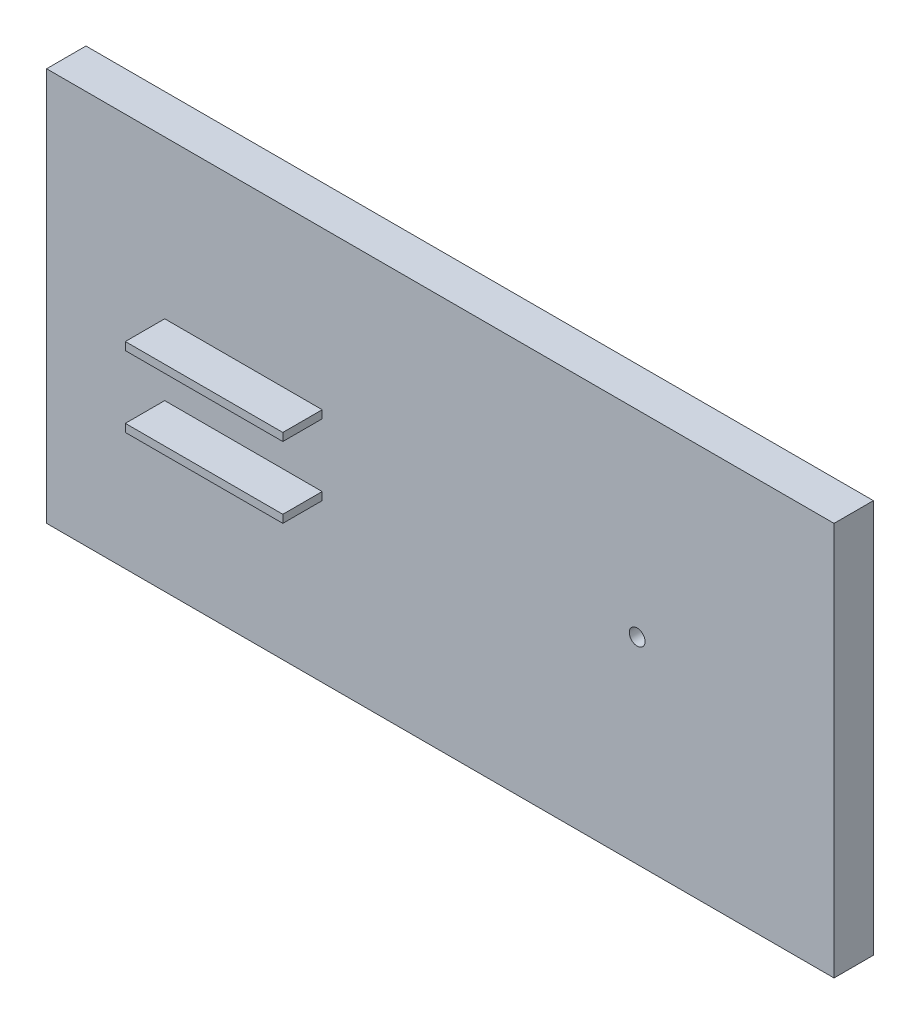
ISO-10303-21;
HEADER;
FILE_DESCRIPTION(('STEP AP214'),'2;1');
FILE_NAME('part.step','',(''),(''),'','','');
FILE_SCHEMA(('AUTOMOTIVE_DESIGN { 1 0 10303 214 1 1 1 1 }'));
ENDSEC;
DATA;
#1=APPLICATION_CONTEXT('core data for automotive mechanical design processes');
#2=APPLICATION_PROTOCOL_DEFINITION('international standard','automotive_design',2000,#1);
#3=PRODUCT_CONTEXT('',#1,'mechanical');
#4=PRODUCT('Part','Part','',(#3));
#5=PRODUCT_RELATED_PRODUCT_CATEGORY('part','',(#4));
#6=PRODUCT_DEFINITION_FORMATION('','',#4);
#7=PRODUCT_DEFINITION_CONTEXT('part definition',#1,'design');
#8=PRODUCT_DEFINITION('design','',#6,#7);
#9=PRODUCT_DEFINITION_SHAPE('','',#8);
#10=(LENGTH_UNIT() NAMED_UNIT(*) SI_UNIT(.MILLI.,.METRE.));
#11=(NAMED_UNIT(*) PLANE_ANGLE_UNIT() SI_UNIT($,.RADIAN.));
#12=(NAMED_UNIT(*) SI_UNIT($,.STERADIAN.) SOLID_ANGLE_UNIT());
#13=UNCERTAINTY_MEASURE_WITH_UNIT(LENGTH_MEASURE(1.E-05),#10,'distance_accuracy_value','');
#14=(GEOMETRIC_REPRESENTATION_CONTEXT(3) GLOBAL_UNCERTAINTY_ASSIGNED_CONTEXT((#13)) GLOBAL_UNIT_ASSIGNED_CONTEXT((#10,
#11,#12)) REPRESENTATION_CONTEXT('',''));
#15=CARTESIAN_POINT('',(0.,0.,0.));
#16=DIRECTION('',(0.,0.,1.));
#17=DIRECTION('',(1.,0.,0.));
#18=AXIS2_PLACEMENT_3D('',#15,#16,#17);
#19=CARTESIAN_POINT('',(-100.,0.,10.));
#20=DIRECTION('',(1.,0.,0.));
#21=DIRECTION('',(0.,0.,-1.));
#22=AXIS2_PLACEMENT_3D('',#19,#20,#21);
#23=PLANE('',#22);
#24=DIRECTION('',(0.,-1.,0.));
#25=VECTOR('',#24,1.);
#26=CARTESIAN_POINT('',(-100.,0.,0.));
#27=LINE('',#26,#25);
#28=CARTESIAN_POINT('',(-100.,50.,0.));
#29=VERTEX_POINT('',#28);
#30=CARTESIAN_POINT('',(-100.,-50.,0.));
#31=VERTEX_POINT('',#30);
#32=EDGE_CURVE('E139',#29,#31,#27,.T.);
#33=ORIENTED_EDGE('',*,*,#32,.T.);
#34=DIRECTION('',(0.,0.,-1.));
#35=VECTOR('',#34,1.);
#36=CARTESIAN_POINT('',(-100.,-50.,10.));
#37=LINE('',#36,#35);
#38=CARTESIAN_POINT('',(-100.,-50.,10.));
#39=VERTEX_POINT('',#38);
#40=EDGE_CURVE('E11',#39,#31,#37,.T.);
#41=ORIENTED_EDGE('',*,*,#40,.F.);
#42=DIRECTION('',(0.,-1.,0.));
#43=VECTOR('',#42,1.);
#44=CARTESIAN_POINT('',(-100.,0.,10.));
#45=LINE('',#44,#43);
#46=CARTESIAN_POINT('',(-100.,50.,10.));
#47=VERTEX_POINT('',#46);
#48=EDGE_CURVE('E80',#47,#39,#45,.T.);
#49=ORIENTED_EDGE('',*,*,#48,.F.);
#50=DIRECTION('',(0.,0.,-1.));
#51=VECTOR('',#50,1.);
#52=CARTESIAN_POINT('',(-100.,50.,10.));
#53=LINE('',#52,#51);
#54=EDGE_CURVE('E96',#47,#29,#53,.T.);
#55=ORIENTED_EDGE('',*,*,#54,.T.);
#56=EDGE_LOOP('',(#33,#41,#49,#55));
#57=FACE_BOUND('',#56,.T.);
#58=ADVANCED_FACE('F33',(#57),#23,.F.);
#59=CARTESIAN_POINT('',(0.,-50.,10.));
#60=DIRECTION('',(0.,-1.,0.));
#61=DIRECTION('',(0.,0.,-1.));
#62=AXIS2_PLACEMENT_3D('',#59,#60,#61);
#63=PLANE('',#62);
#64=DIRECTION('',(-1.,0.,0.));
#65=VECTOR('',#64,1.);
#66=CARTESIAN_POINT('',(0.,-50.,0.));
#67=LINE('',#66,#65);
#68=CARTESIAN_POINT('',(100.,-50.,0.));
#69=VERTEX_POINT('',#68);
#70=EDGE_CURVE('E141',#69,#31,#67,.T.);
#71=ORIENTED_EDGE('',*,*,#70,.F.);
#72=DIRECTION('',(0.,0.,-1.));
#73=VECTOR('',#72,1.);
#74=CARTESIAN_POINT('',(100.,-50.,10.));
#75=LINE('',#74,#73);
#76=CARTESIAN_POINT('',(100.,-50.,10.));
#77=VERTEX_POINT('',#76);
#78=EDGE_CURVE('E41',#77,#69,#75,.T.);
#79=ORIENTED_EDGE('',*,*,#78,.F.);
#80=DIRECTION('',(-1.,0.,0.));
#81=VECTOR('',#80,1.);
#82=CARTESIAN_POINT('',(0.,-50.,10.));
#83=LINE('',#82,#81);
#84=EDGE_CURVE('E104',#77,#39,#83,.T.);
#85=ORIENTED_EDGE('',*,*,#84,.T.);
#86=ORIENTED_EDGE('',*,*,#40,.T.);
#87=EDGE_LOOP('',(#71,#79,#85,#86));
#88=FACE_BOUND('',#87,.T.);
#89=ADVANCED_FACE('F154',(#88),#63,.T.);
#90=CARTESIAN_POINT('',(100.,0.,10.));
#91=DIRECTION('',(1.,0.,0.));
#92=DIRECTION('',(0.,0.,-1.));
#93=AXIS2_PLACEMENT_3D('',#90,#91,#92);
#94=PLANE('',#93);
#95=DIRECTION('',(0.,-1.,0.));
#96=VECTOR('',#95,1.);
#97=CARTESIAN_POINT('',(100.,0.,0.));
#98=LINE('',#97,#96);
#99=CARTESIAN_POINT('',(100.,50.,0.));
#100=VERTEX_POINT('',#99);
#101=EDGE_CURVE('E145',#100,#69,#98,.T.);
#102=ORIENTED_EDGE('',*,*,#101,.F.);
#103=DIRECTION('',(0.,0.,-1.));
#104=VECTOR('',#103,1.);
#105=CARTESIAN_POINT('',(100.,50.,10.));
#106=LINE('',#105,#104);
#107=CARTESIAN_POINT('',(100.,50.,10.));
#108=VERTEX_POINT('',#107);
#109=EDGE_CURVE('E67',#108,#100,#106,.T.);
#110=ORIENTED_EDGE('',*,*,#109,.F.);
#111=DIRECTION('',(0.,-1.,0.));
#112=VECTOR('',#111,1.);
#113=CARTESIAN_POINT('',(100.,0.,10.));
#114=LINE('',#113,#112);
#115=EDGE_CURVE('E93',#108,#77,#114,.T.);
#116=ORIENTED_EDGE('',*,*,#115,.T.);
#117=ORIENTED_EDGE('',*,*,#78,.T.);
#118=EDGE_LOOP('',(#102,#110,#116,#117));
#119=FACE_BOUND('',#118,.T.);
#120=ADVANCED_FACE('F152',(#119),#94,.T.);
#121=CARTESIAN_POINT('',(50.,0.,10.));
#122=DIRECTION('',(0.,0.,-1.));
#123=DIRECTION('',(-1.,0.,0.));
#124=AXIS2_PLACEMENT_3D('',#121,#122,#123);
#125=CYLINDRICAL_SURFACE('',#124,2.);
#126=CARTESIAN_POINT('',(50.,0.,10.));
#127=DIRECTION('',(0.,0.,1.));
#128=DIRECTION('',(1.,0.,0.));
#129=AXIS2_PLACEMENT_3D('',#126,#127,#128);
#130=CIRCLE('',#129,2.);
#131=CARTESIAN_POINT('',(52.,0.,10.));
#132=VERTEX_POINT('',#131);
#133=EDGE_CURVE('E94',#132,#132,#130,.T.);
#134=ORIENTED_EDGE('',*,*,#133,.T.);
#135=EDGE_LOOP('',(#134));
#136=FACE_BOUND('',#135,.T.);
#137=CARTESIAN_POINT('',(50.,0.,0.));
#138=DIRECTION('',(0.,0.,1.));
#139=DIRECTION('',(1.,0.,0.));
#140=AXIS2_PLACEMENT_3D('',#137,#138,#139);
#141=CIRCLE('',#140,2.);
#142=CARTESIAN_POINT('',(52.,0.,0.));
#143=VERTEX_POINT('',#142);
#144=EDGE_CURVE('E105',#143,#143,#141,.T.);
#145=ORIENTED_EDGE('',*,*,#144,.F.);
#146=EDGE_LOOP('',(#145));
#147=FACE_BOUND('',#146,.T.);
#148=ADVANCED_FACE('F163',(#136,#147),#125,.F.);
#149=CARTESIAN_POINT('',(0.,50.,10.));
#150=DIRECTION('',(0.,-1.,0.));
#151=DIRECTION('',(0.,0.,-1.));
#152=AXIS2_PLACEMENT_3D('',#149,#150,#151);
#153=PLANE('',#152);
#154=DIRECTION('',(-1.,0.,0.));
#155=VECTOR('',#154,1.);
#156=CARTESIAN_POINT('',(0.,50.,0.));
#157=LINE('',#156,#155);
#158=EDGE_CURVE('E71',#100,#29,#157,.T.);
#159=ORIENTED_EDGE('',*,*,#158,.T.);
#160=ORIENTED_EDGE('',*,*,#54,.F.);
#161=DIRECTION('',(-1.,0.,0.));
#162=VECTOR('',#161,1.);
#163=CARTESIAN_POINT('',(0.,50.,10.));
#164=LINE('',#163,#162);
#165=EDGE_CURVE('E89',#108,#47,#164,.T.);
#166=ORIENTED_EDGE('',*,*,#165,.F.);
#167=ORIENTED_EDGE('',*,*,#109,.T.);
#168=EDGE_LOOP('',(#159,#160,#166,#167));
#169=FACE_BOUND('',#168,.T.);
#170=ADVANCED_FACE('F97',(#169),#153,.F.);
#171=CARTESIAN_POINT('',(0.,0.,10.));
#172=DIRECTION('',(0.,0.,1.));
#173=DIRECTION('',(1.,0.,0.));
#174=AXIS2_PLACEMENT_3D('',#171,#172,#173);
#175=PLANE('',#174);
#176=ORIENTED_EDGE('',*,*,#48,.T.);
#177=ORIENTED_EDGE('',*,*,#84,.F.);
#178=ORIENTED_EDGE('',*,*,#115,.F.);
#179=ORIENTED_EDGE('',*,*,#165,.T.);
#180=EDGE_LOOP('',(#176,#177,#178,#179));
#181=FACE_BOUND('',#180,.T.);
#182=ORIENTED_EDGE('',*,*,#133,.F.);
#183=EDGE_LOOP('',(#182));
#184=FACE_BOUND('',#183,.T.);
#185=DIRECTION('',(1.,0.,0.));
#186=VECTOR('',#185,1.);
#187=CARTESIAN_POINT('',(0.,-10.,10.));
#188=LINE('',#187,#186);
#189=CARTESIAN_POINT('',(-70.,-10.,10.));
#190=VERTEX_POINT('',#189);
#191=CARTESIAN_POINT('',(-30.,-10.,10.));
#192=VERTEX_POINT('',#191);
#193=EDGE_CURVE('E117',#190,#192,#188,.T.);
#194=ORIENTED_EDGE('',*,*,#193,.F.);
#195=DIRECTION('',(0.,-1.,0.));
#196=VECTOR('',#195,1.);
#197=CARTESIAN_POINT('',(-70.0000000000001,-4.85722573273506E-13,10.));
#198=LINE('',#197,#196);
#199=CARTESIAN_POINT('',(-70.,-8.00000000000001,10.));
#200=VERTEX_POINT('',#199);
#201=EDGE_CURVE('E120',#200,#190,#198,.T.);
#202=ORIENTED_EDGE('',*,*,#201,.F.);
#203=DIRECTION('',(1.,0.,0.));
#204=VECTOR('',#203,1.);
#205=CARTESIAN_POINT('',(0.,-8.00000000000001,10.));
#206=LINE('',#205,#204);
#207=CARTESIAN_POINT('',(-30.,-8.00000000000001,10.));
#208=VERTEX_POINT('',#207);
#209=EDGE_CURVE('E123',#200,#208,#206,.T.);
#210=ORIENTED_EDGE('',*,*,#209,.T.);
#211=DIRECTION('',(0.,-1.,0.));
#212=VECTOR('',#211,1.);
#213=CARTESIAN_POINT('',(-30.,-1.04083408558609E-13,10.));
#214=LINE('',#213,#212);
#215=EDGE_CURVE('E126',#208,#192,#214,.T.);
#216=ORIENTED_EDGE('',*,*,#215,.T.);
#217=EDGE_LOOP('',(#194,#202,#210,#216));
#218=FACE_BOUND('',#217,.T.);
#219=DIRECTION('',(0.,1.,0.));
#220=VECTOR('',#219,1.);
#221=CARTESIAN_POINT('',(-69.9999999999999,-9.7144514654701E-13,10.));
#222=LINE('',#221,#220);
#223=CARTESIAN_POINT('',(-70.,7.99999999999999,10.));
#224=VERTEX_POINT('',#223);
#225=CARTESIAN_POINT('',(-70.,9.99999999999999,10.));
#226=VERTEX_POINT('',#225);
#227=EDGE_CURVE('E129',#224,#226,#222,.T.);
#228=ORIENTED_EDGE('',*,*,#227,.T.);
#229=DIRECTION('',(1.,0.,0.));
#230=VECTOR('',#229,1.);
#231=CARTESIAN_POINT('',(0.,9.99999999999999,10.));
#232=LINE('',#231,#230);
#233=CARTESIAN_POINT('',(-30.,9.99999999999999,10.));
#234=VERTEX_POINT('',#233);
#235=EDGE_CURVE('E132',#226,#234,#232,.T.);
#236=ORIENTED_EDGE('',*,*,#235,.T.);
#237=DIRECTION('',(0.,1.,0.));
#238=VECTOR('',#237,1.);
#239=CARTESIAN_POINT('',(-29.9999999999999,-3.12250225675824E-13,10.));
#240=LINE('',#239,#238);
#241=CARTESIAN_POINT('',(-30.,7.99999999999999,10.));
#242=VERTEX_POINT('',#241);
#243=EDGE_CURVE('E135',#242,#234,#240,.T.);
#244=ORIENTED_EDGE('',*,*,#243,.F.);
#245=DIRECTION('',(1.,0.,0.));
#246=VECTOR('',#245,1.);
#247=CARTESIAN_POINT('',(0.,7.99999999999999,10.));
#248=LINE('',#247,#246);
#249=EDGE_CURVE('E101',#224,#242,#248,.T.);
#250=ORIENTED_EDGE('',*,*,#249,.F.);
#251=EDGE_LOOP('',(#228,#236,#244,#250));
#252=FACE_BOUND('',#251,.T.);
#253=ADVANCED_FACE('F90',(#181,#184,#218,#252),#175,.T.);
#254=CARTESIAN_POINT('',(0.,0.,0.));
#255=DIRECTION('',(0.,0.,1.));
#256=DIRECTION('',(1.,0.,0.));
#257=AXIS2_PLACEMENT_3D('',#254,#255,#256);
#258=PLANE('',#257);
#259=ORIENTED_EDGE('',*,*,#32,.F.);
#260=ORIENTED_EDGE('',*,*,#158,.F.);
#261=ORIENTED_EDGE('',*,*,#101,.T.);
#262=ORIENTED_EDGE('',*,*,#70,.T.);
#263=EDGE_LOOP('',(#259,#260,#261,#262));
#264=FACE_BOUND('',#263,.T.);
#265=ORIENTED_EDGE('',*,*,#144,.T.);
#266=EDGE_LOOP('',(#265));
#267=FACE_BOUND('',#266,.T.);
#268=ADVANCED_FACE('F156',(#264,#267),#258,.F.);
#269=CARTESIAN_POINT('',(-70.,7.99999999999999,20.));
#270=DIRECTION('',(-1.,0.,0.));
#271=DIRECTION('',(0.,-1.,0.));
#272=AXIS2_PLACEMENT_3D('',#269,#270,#271);
#273=PLANE('',#272);
#274=DIRECTION('',(0.,0.,-1.));
#275=VECTOR('',#274,1.);
#276=CARTESIAN_POINT('',(-70.,9.99999999999999,20.));
#277=LINE('',#276,#275);
#278=CARTESIAN_POINT('',(-70.,9.99999999999999,20.));
#279=VERTEX_POINT('',#278);
#280=EDGE_CURVE('E111',#279,#226,#277,.T.);
#281=ORIENTED_EDGE('',*,*,#280,.T.);
#282=ORIENTED_EDGE('',*,*,#227,.F.);
#283=DIRECTION('',(0.,0.,-1.));
#284=VECTOR('',#283,1.);
#285=CARTESIAN_POINT('',(-70.,7.99999999999999,20.));
#286=LINE('',#285,#284);
#287=CARTESIAN_POINT('',(-70.,7.99999999999999,20.));
#288=VERTEX_POINT('',#287);
#289=EDGE_CURVE('E142',#288,#224,#286,.T.);
#290=ORIENTED_EDGE('',*,*,#289,.F.);
#291=DIRECTION('',(0.,1.,0.));
#292=VECTOR('',#291,1.);
#293=CARTESIAN_POINT('',(-70.,7.99999999999999,20.));
#294=LINE('',#293,#292);
#295=EDGE_CURVE('E329',#288,#279,#294,.T.);
#296=ORIENTED_EDGE('',*,*,#295,.T.);
#297=EDGE_LOOP('',(#281,#282,#290,#296));
#298=FACE_BOUND('',#297,.T.);
#299=ADVANCED_FACE('F159',(#298),#273,.T.);
#300=CARTESIAN_POINT('',(-70.,7.99999999999999,20.));
#301=DIRECTION('',(0.,1.,0.));
#302=DIRECTION('',(0.,0.,1.));
#303=AXIS2_PLACEMENT_3D('',#300,#301,#302);
#304=PLANE('',#303);
#305=ORIENTED_EDGE('',*,*,#249,.T.);
#306=DIRECTION('',(0.,0.,-1.));
#307=VECTOR('',#306,1.);
#308=CARTESIAN_POINT('',(-30.,7.99999999999999,20.));
#309=LINE('',#308,#307);
#310=CARTESIAN_POINT('',(-30.,7.99999999999999,20.));
#311=VERTEX_POINT('',#310);
#312=EDGE_CURVE('E362',#311,#242,#309,.T.);
#313=ORIENTED_EDGE('',*,*,#312,.F.);
#314=DIRECTION('',(1.,0.,0.));
#315=VECTOR('',#314,1.);
#316=CARTESIAN_POINT('',(-70.,7.99999999999999,20.));
#317=LINE('',#316,#315);
#318=EDGE_CURVE('E357',#288,#311,#317,.T.);
#319=ORIENTED_EDGE('',*,*,#318,.F.);
#320=ORIENTED_EDGE('',*,*,#289,.T.);
#321=EDGE_LOOP('',(#305,#313,#319,#320));
#322=FACE_BOUND('',#321,.T.);
#323=ADVANCED_FACE('F218',(#322),#304,.F.);
#324=CARTESIAN_POINT('',(-30.,7.99999999999999,20.));
#325=DIRECTION('',(-1.,0.,0.));
#326=DIRECTION('',(0.,-1.,0.));
#327=AXIS2_PLACEMENT_3D('',#324,#325,#326);
#328=PLANE('',#327);
#329=ORIENTED_EDGE('',*,*,#243,.T.);
#330=DIRECTION('',(0.,0.,-1.));
#331=VECTOR('',#330,1.);
#332=CARTESIAN_POINT('',(-30.,9.99999999999999,20.));
#333=LINE('',#332,#331);
#334=CARTESIAN_POINT('',(-30.,9.99999999999999,20.));
#335=VERTEX_POINT('',#334);
#336=EDGE_CURVE('E49',#335,#234,#333,.T.);
#337=ORIENTED_EDGE('',*,*,#336,.F.);
#338=DIRECTION('',(0.,1.,0.));
#339=VECTOR('',#338,1.);
#340=CARTESIAN_POINT('',(-30.,7.99999999999999,20.));
#341=LINE('',#340,#339);
#342=EDGE_CURVE('E354',#311,#335,#341,.T.);
#343=ORIENTED_EDGE('',*,*,#342,.F.);
#344=ORIENTED_EDGE('',*,*,#312,.T.);
#345=EDGE_LOOP('',(#329,#337,#343,#344));
#346=FACE_BOUND('',#345,.T.);
#347=ADVANCED_FACE('F228',(#346),#328,.F.);
#348=CARTESIAN_POINT('',(-70.,9.99999999999999,20.));
#349=DIRECTION('',(0.,1.,0.));
#350=DIRECTION('',(0.,0.,1.));
#351=AXIS2_PLACEMENT_3D('',#348,#349,#350);
#352=PLANE('',#351);
#353=ORIENTED_EDGE('',*,*,#336,.T.);
#354=ORIENTED_EDGE('',*,*,#235,.F.);
#355=ORIENTED_EDGE('',*,*,#280,.F.);
#356=DIRECTION('',(1.,0.,0.));
#357=VECTOR('',#356,1.);
#358=CARTESIAN_POINT('',(-70.,9.99999999999999,20.));
#359=LINE('',#358,#357);
#360=EDGE_CURVE('E352',#279,#335,#359,.T.);
#361=ORIENTED_EDGE('',*,*,#360,.T.);
#362=EDGE_LOOP('',(#353,#354,#355,#361));
#363=FACE_BOUND('',#362,.T.);
#364=ADVANCED_FACE('F238',(#363),#352,.T.);
#365=CARTESIAN_POINT('',(0.,0.,20.));
#366=DIRECTION('',(0.,0.,-1.));
#367=DIRECTION('',(-1.,0.,0.));
#368=AXIS2_PLACEMENT_3D('',#365,#366,#367);
#369=PLANE('',#368);
#370=ORIENTED_EDGE('',*,*,#295,.F.);
#371=ORIENTED_EDGE('',*,*,#318,.T.);
#372=ORIENTED_EDGE('',*,*,#342,.T.);
#373=ORIENTED_EDGE('',*,*,#360,.F.);
#374=EDGE_LOOP('',(#370,#371,#372,#373));
#375=FACE_BOUND('',#374,.T.);
#376=ADVANCED_FACE('F248',(#375),#369,.F.);
#377=CARTESIAN_POINT('',(-70.,-8.00000000000001,20.));
#378=DIRECTION('',(1.,0.,0.));
#379=DIRECTION('',(0.,1.,0.));
#380=AXIS2_PLACEMENT_3D('',#377,#378,#379);
#381=PLANE('',#380);
#382=ORIENTED_EDGE('',*,*,#201,.T.);
#383=DIRECTION('',(0.,0.,-1.));
#384=VECTOR('',#383,1.);
#385=CARTESIAN_POINT('',(-70.,-10.,20.));
#386=LINE('',#385,#384);
#387=CARTESIAN_POINT('',(-70.,-10.,20.));
#388=VERTEX_POINT('',#387);
#389=EDGE_CURVE('E332',#388,#190,#386,.T.);
#390=ORIENTED_EDGE('',*,*,#389,.F.);
#391=DIRECTION('',(0.,-1.,0.));
#392=VECTOR('',#391,1.);
#393=CARTESIAN_POINT('',(-70.,-8.00000000000001,20.));
#394=LINE('',#393,#392);
#395=CARTESIAN_POINT('',(-70.,-8.00000000000001,20.));
#396=VERTEX_POINT('',#395);
#397=EDGE_CURVE('E316',#396,#388,#394,.T.);
#398=ORIENTED_EDGE('',*,*,#397,.F.);
#399=DIRECTION('',(0.,0.,-1.));
#400=VECTOR('',#399,1.);
#401=CARTESIAN_POINT('',(-70.,-8.00000000000001,20.));
#402=LINE('',#401,#400);
#403=EDGE_CURVE('E343',#396,#200,#402,.T.);
#404=ORIENTED_EDGE('',*,*,#403,.T.);
#405=EDGE_LOOP('',(#382,#390,#398,#404));
#406=FACE_BOUND('',#405,.T.);
#407=ADVANCED_FACE('F257',(#406),#381,.F.);
#408=CARTESIAN_POINT('',(-70.,-10.,20.));
#409=DIRECTION('',(0.,1.,0.));
#410=DIRECTION('',(0.,0.,1.));
#411=AXIS2_PLACEMENT_3D('',#408,#409,#410);
#412=PLANE('',#411);
#413=ORIENTED_EDGE('',*,*,#193,.T.);
#414=DIRECTION('',(0.,0.,-1.));
#415=VECTOR('',#414,1.);
#416=CARTESIAN_POINT('',(-30.,-10.,20.));
#417=LINE('',#416,#415);
#418=CARTESIAN_POINT('',(-30.,-10.,20.));
#419=VERTEX_POINT('',#418);
#420=EDGE_CURVE('E336',#419,#192,#417,.T.);
#421=ORIENTED_EDGE('',*,*,#420,.F.);
#422=DIRECTION('',(1.,0.,0.));
#423=VECTOR('',#422,1.);
#424=CARTESIAN_POINT('',(-70.,-10.,20.));
#425=LINE('',#424,#423);
#426=EDGE_CURVE('E321',#388,#419,#425,.T.);
#427=ORIENTED_EDGE('',*,*,#426,.F.);
#428=ORIENTED_EDGE('',*,*,#389,.T.);
#429=EDGE_LOOP('',(#413,#421,#427,#428));
#430=FACE_BOUND('',#429,.T.);
#431=ADVANCED_FACE('F267',(#430),#412,.F.);
#432=CARTESIAN_POINT('',(-30.,-8.00000000000001,20.));
#433=DIRECTION('',(1.,0.,0.));
#434=DIRECTION('',(0.,1.,0.));
#435=AXIS2_PLACEMENT_3D('',#432,#433,#434);
#436=PLANE('',#435);
#437=ORIENTED_EDGE('',*,*,#420,.T.);
#438=ORIENTED_EDGE('',*,*,#215,.F.);
#439=DIRECTION('',(0.,0.,-1.));
#440=VECTOR('',#439,1.);
#441=CARTESIAN_POINT('',(-30.,-8.00000000000001,20.));
#442=LINE('',#441,#440);
#443=CARTESIAN_POINT('',(-30.,-8.00000000000001,20.));
#444=VERTEX_POINT('',#443);
#445=EDGE_CURVE('E339',#444,#208,#442,.T.);
#446=ORIENTED_EDGE('',*,*,#445,.F.);
#447=DIRECTION('',(0.,-1.,0.));
#448=VECTOR('',#447,1.);
#449=CARTESIAN_POINT('',(-30.,-8.00000000000001,20.));
#450=LINE('',#449,#448);
#451=EDGE_CURVE('E346',#444,#419,#450,.T.);
#452=ORIENTED_EDGE('',*,*,#451,.T.);
#453=EDGE_LOOP('',(#437,#438,#446,#452));
#454=FACE_BOUND('',#453,.T.);
#455=ADVANCED_FACE('F277',(#454),#436,.T.);
#456=CARTESIAN_POINT('',(-70.,-8.00000000000001,20.));
#457=DIRECTION('',(0.,1.,0.));
#458=DIRECTION('',(0.,0.,1.));
#459=AXIS2_PLACEMENT_3D('',#456,#457,#458);
#460=PLANE('',#459);
#461=ORIENTED_EDGE('',*,*,#445,.T.);
#462=ORIENTED_EDGE('',*,*,#209,.F.);
#463=ORIENTED_EDGE('',*,*,#403,.F.);
#464=DIRECTION('',(1.,0.,0.));
#465=VECTOR('',#464,1.);
#466=CARTESIAN_POINT('',(-70.,-8.00000000000001,20.));
#467=LINE('',#466,#465);
#468=EDGE_CURVE('E325',#396,#444,#467,.T.);
#469=ORIENTED_EDGE('',*,*,#468,.T.);
#470=EDGE_LOOP('',(#461,#462,#463,#469));
#471=FACE_BOUND('',#470,.T.);
#472=ADVANCED_FACE('F287',(#471),#460,.T.);
#473=CARTESIAN_POINT('',(0.,0.,20.));
#474=DIRECTION('',(0.,0.,1.));
#475=DIRECTION('',(1.,0.,0.));
#476=AXIS2_PLACEMENT_3D('',#473,#474,#475);
#477=PLANE('',#476);
#478=ORIENTED_EDGE('',*,*,#397,.T.);
#479=ORIENTED_EDGE('',*,*,#426,.T.);
#480=ORIENTED_EDGE('',*,*,#451,.F.);
#481=ORIENTED_EDGE('',*,*,#468,.F.);
#482=EDGE_LOOP('',(#478,#479,#480,#481));
#483=FACE_BOUND('',#482,.T.);
#484=ADVANCED_FACE('F297',(#483),#477,.T.);
#485=CLOSED_SHELL('',(#58,#89,#120,#148,#170,#253,#268,#299,#323,#347,#364,#376,#407,#431,#455,
#472,#484));
#486=MANIFOLD_SOLID_BREP('B2',#485);
#487=ADVANCED_BREP_SHAPE_REPRESENTATION('',(#18,#486),#14);
#488=SHAPE_DEFINITION_REPRESENTATION(#9,#487);
ENDSEC;
END-ISO-10303-21;
